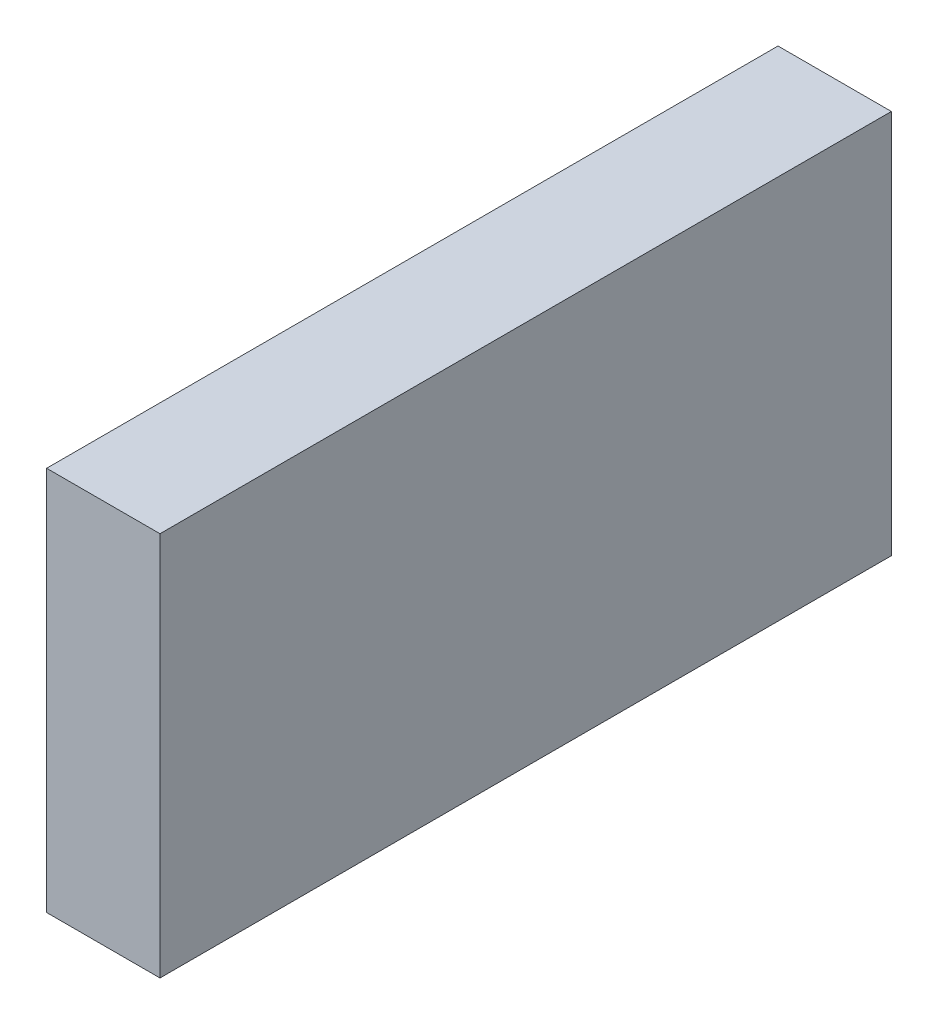
ISO-10303-21;
HEADER;
FILE_DESCRIPTION(('STEP AP214'),'2;1');
FILE_NAME('part.step','',(''),(''),'','','');
FILE_SCHEMA(('AUTOMOTIVE_DESIGN { 1 0 10303 214 1 1 1 1 }'));
ENDSEC;
DATA;
#1=APPLICATION_CONTEXT('core data for automotive mechanical design processes');
#2=APPLICATION_PROTOCOL_DEFINITION('international standard','automotive_design',2000,#1);
#3=PRODUCT_CONTEXT('',#1,'mechanical');
#4=PRODUCT('Part','Part','',(#3));
#5=PRODUCT_RELATED_PRODUCT_CATEGORY('part','',(#4));
#6=PRODUCT_DEFINITION_FORMATION('','',#4);
#7=PRODUCT_DEFINITION_CONTEXT('part definition',#1,'design');
#8=PRODUCT_DEFINITION('design','',#6,#7);
#9=PRODUCT_DEFINITION_SHAPE('','',#8);
#10=(LENGTH_UNIT() NAMED_UNIT(*) SI_UNIT(.MILLI.,.METRE.));
#11=(NAMED_UNIT(*) PLANE_ANGLE_UNIT() SI_UNIT($,.RADIAN.));
#12=(NAMED_UNIT(*) SI_UNIT($,.STERADIAN.) SOLID_ANGLE_UNIT());
#13=UNCERTAINTY_MEASURE_WITH_UNIT(LENGTH_MEASURE(1.E-05),#10,'distance_accuracy_value','');
#14=(GEOMETRIC_REPRESENTATION_CONTEXT(3) GLOBAL_UNCERTAINTY_ASSIGNED_CONTEXT((#13)) GLOBAL_UNIT_ASSIGNED_CONTEXT((#10,
#11,#12)) REPRESENTATION_CONTEXT('',''));
#15=CARTESIAN_POINT('',(0.,0.,0.));
#16=DIRECTION('',(0.,0.,1.));
#17=DIRECTION('',(1.,0.,0.));
#18=AXIS2_PLACEMENT_3D('',#15,#16,#17);
#19=CARTESIAN_POINT('',(247.480579420327,10.,-75.2974570796293));
#20=DIRECTION('',(0.,0.,1.));
#21=DIRECTION('',(1.,0.,0.));
#22=AXIS2_PLACEMENT_3D('',#19,#20,#21);
#23=PLANE('',#22);
#24=DIRECTION('',(-1.,0.,0.));
#25=VECTOR('',#24,1.);
#26=CARTESIAN_POINT('',(247.480579420327,0.,-75.2974570796293));
#27=LINE('',#26,#25);
#28=CARTESIAN_POINT('',(247.480579420327,0.,-75.2974570796293));
#29=VERTEX_POINT('',#28);
#30=CARTESIAN_POINT('',(244.534062283818,0.,-75.2974570796293));
#31=VERTEX_POINT('',#30);
#32=EDGE_CURVE('E93',#29,#31,#27,.T.);
#33=ORIENTED_EDGE('',*,*,#32,.T.);
#34=DIRECTION('',(0.,-1.,0.));
#35=VECTOR('',#34,1.);
#36=CARTESIAN_POINT('',(244.534062283818,10.,-75.2974570796293));
#37=LINE('',#36,#35);
#38=CARTESIAN_POINT('',(244.534062283818,10.,-75.2974570796293));
#39=VERTEX_POINT('',#38);
#40=EDGE_CURVE('E11',#39,#31,#37,.T.);
#41=ORIENTED_EDGE('',*,*,#40,.F.);
#42=DIRECTION('',(-1.,0.,0.));
#43=VECTOR('',#42,1.);
#44=CARTESIAN_POINT('',(247.480579420327,10.,-75.2974570796293));
#45=LINE('',#44,#43);
#46=CARTESIAN_POINT('',(247.480579420327,10.,-75.2974570796293));
#47=VERTEX_POINT('',#46);
#48=EDGE_CURVE('E81',#47,#39,#45,.T.);
#49=ORIENTED_EDGE('',*,*,#48,.F.);
#50=DIRECTION('',(0.,-1.,0.));
#51=VECTOR('',#50,1.);
#52=CARTESIAN_POINT('',(247.480579420327,10.,-75.2974570796293));
#53=LINE('',#52,#51);
#54=EDGE_CURVE('E89',#47,#29,#53,.T.);
#55=ORIENTED_EDGE('',*,*,#54,.T.);
#56=EDGE_LOOP('',(#33,#41,#49,#55));
#57=FACE_BOUND('',#56,.T.);
#58=ADVANCED_FACE('F30',(#57),#23,.F.);
#59=CARTESIAN_POINT('',(244.534062283818,10.,-75.2974570796293));
#60=DIRECTION('',(1.,0.,0.));
#61=DIRECTION('',(0.,0.,-1.));
#62=AXIS2_PLACEMENT_3D('',#59,#60,#61);
#63=PLANE('',#62);
#64=DIRECTION('',(0.,0.,1.));
#65=VECTOR('',#64,1.);
#66=CARTESIAN_POINT('',(244.534062283818,0.,-75.2974570796293));
#67=LINE('',#66,#65);
#68=CARTESIAN_POINT('',(244.534062283818,0.,-56.28859622837));
#69=VERTEX_POINT('',#68);
#70=EDGE_CURVE('E85',#31,#69,#67,.T.);
#71=ORIENTED_EDGE('',*,*,#70,.T.);
#72=DIRECTION('',(0.,-1.,0.));
#73=VECTOR('',#72,1.);
#74=CARTESIAN_POINT('',(244.534062283818,10.,-56.28859622837));
#75=LINE('',#74,#73);
#76=CARTESIAN_POINT('',(244.534062283818,10.,-56.28859622837));
#77=VERTEX_POINT('',#76);
#78=EDGE_CURVE('E38',#77,#69,#75,.T.);
#79=ORIENTED_EDGE('',*,*,#78,.F.);
#80=DIRECTION('',(0.,0.,1.));
#81=VECTOR('',#80,1.);
#82=CARTESIAN_POINT('',(244.534062283818,10.,-75.2974570796293));
#83=LINE('',#82,#81);
#84=EDGE_CURVE('E76',#39,#77,#83,.T.);
#85=ORIENTED_EDGE('',*,*,#84,.F.);
#86=ORIENTED_EDGE('',*,*,#40,.T.);
#87=EDGE_LOOP('',(#71,#79,#85,#86));
#88=FACE_BOUND('',#87,.T.);
#89=ADVANCED_FACE('F84',(#88),#63,.F.);
#90=CARTESIAN_POINT('',(244.534062283818,10.,-56.28859622837));
#91=DIRECTION('',(0.,0.,-1.));
#92=DIRECTION('',(-1.,0.,0.));
#93=AXIS2_PLACEMENT_3D('',#90,#91,#92);
#94=PLANE('',#93);
#95=DIRECTION('',(1.,0.,0.));
#96=VECTOR('',#95,1.);
#97=CARTESIAN_POINT('',(244.534062283818,0.,-56.28859622837));
#98=LINE('',#97,#96);
#99=CARTESIAN_POINT('',(247.480579420327,0.,-56.28859622837));
#100=VERTEX_POINT('',#99);
#101=EDGE_CURVE('E63',#69,#100,#98,.T.);
#102=ORIENTED_EDGE('',*,*,#101,.T.);
#103=DIRECTION('',(0.,-1.,0.));
#104=VECTOR('',#103,1.);
#105=CARTESIAN_POINT('',(247.480579420327,10.,-56.28859622837));
#106=LINE('',#105,#104);
#107=CARTESIAN_POINT('',(247.480579420327,10.,-56.28859622837));
#108=VERTEX_POINT('',#107);
#109=EDGE_CURVE('E86',#108,#100,#106,.T.);
#110=ORIENTED_EDGE('',*,*,#109,.F.);
#111=DIRECTION('',(1.,0.,0.));
#112=VECTOR('',#111,1.);
#113=CARTESIAN_POINT('',(244.534062283818,10.,-56.28859622837));
#114=LINE('',#113,#112);
#115=EDGE_CURVE('E79',#77,#108,#114,.T.);
#116=ORIENTED_EDGE('',*,*,#115,.F.);
#117=ORIENTED_EDGE('',*,*,#78,.T.);
#118=EDGE_LOOP('',(#102,#110,#116,#117));
#119=FACE_BOUND('',#118,.T.);
#120=ADVANCED_FACE('F87',(#119),#94,.F.);
#121=CARTESIAN_POINT('',(247.480579420327,10.,-56.28859622837));
#122=DIRECTION('',(-1.,0.,0.));
#123=DIRECTION('',(0.,0.,1.));
#124=AXIS2_PLACEMENT_3D('',#121,#122,#123);
#125=PLANE('',#124);
#126=DIRECTION('',(0.,0.,-1.));
#127=VECTOR('',#126,1.);
#128=CARTESIAN_POINT('',(247.480579420327,0.,-56.28859622837));
#129=LINE('',#128,#127);
#130=EDGE_CURVE('E69',#100,#29,#129,.T.);
#131=ORIENTED_EDGE('',*,*,#130,.T.);
#132=ORIENTED_EDGE('',*,*,#54,.F.);
#133=DIRECTION('',(0.,0.,-1.));
#134=VECTOR('',#133,1.);
#135=CARTESIAN_POINT('',(247.480579420327,10.,-56.28859622837));
#136=LINE('',#135,#134);
#137=EDGE_CURVE('E46',#108,#47,#136,.T.);
#138=ORIENTED_EDGE('',*,*,#137,.F.);
#139=ORIENTED_EDGE('',*,*,#109,.T.);
#140=EDGE_LOOP('',(#131,#132,#138,#139));
#141=FACE_BOUND('',#140,.T.);
#142=ADVANCED_FACE('F100',(#141),#125,.F.);
#143=CARTESIAN_POINT('',(0.,10.,0.));
#144=DIRECTION('',(0.,1.,0.));
#145=DIRECTION('',(0.,0.,1.));
#146=AXIS2_PLACEMENT_3D('',#143,#144,#145);
#147=PLANE('',#146);
#148=ORIENTED_EDGE('',*,*,#48,.T.);
#149=ORIENTED_EDGE('',*,*,#84,.T.);
#150=ORIENTED_EDGE('',*,*,#115,.T.);
#151=ORIENTED_EDGE('',*,*,#137,.T.);
#152=EDGE_LOOP('',(#148,#149,#150,#151));
#153=FACE_BOUND('',#152,.T.);
#154=ADVANCED_FACE('F77',(#153),#147,.T.);
#155=CARTESIAN_POINT('',(0.,0.,0.));
#156=DIRECTION('',(0.,1.,0.));
#157=DIRECTION('',(0.,0.,1.));
#158=AXIS2_PLACEMENT_3D('',#155,#156,#157);
#159=PLANE('',#158);
#160=ORIENTED_EDGE('',*,*,#32,.F.);
#161=ORIENTED_EDGE('',*,*,#130,.F.);
#162=ORIENTED_EDGE('',*,*,#101,.F.);
#163=ORIENTED_EDGE('',*,*,#70,.F.);
#164=EDGE_LOOP('',(#160,#161,#162,#163));
#165=FACE_BOUND('',#164,.T.);
#166=ADVANCED_FACE('F103',(#165),#159,.F.);
#167=CLOSED_SHELL('',(#58,#89,#120,#142,#154,#166));
#168=MANIFOLD_SOLID_BREP('B2',#167);
#169=ADVANCED_BREP_SHAPE_REPRESENTATION('',(#18,#168),#14);
#170=SHAPE_DEFINITION_REPRESENTATION(#9,#169);
ENDSEC;
END-ISO-10303-21;
